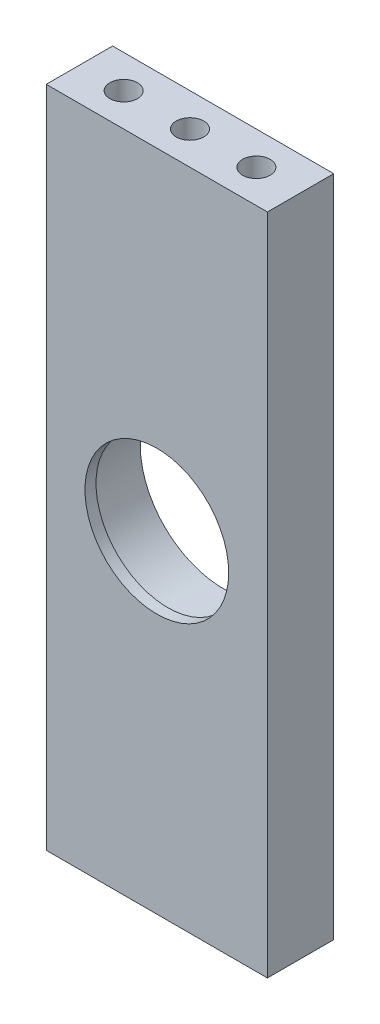
ISO-10303-21;
HEADER;
FILE_DESCRIPTION(('STEP AP214'),'2;1');
FILE_NAME('part.step','',(''),(''),'','','');
FILE_SCHEMA(('AUTOMOTIVE_DESIGN { 1 0 10303 214 1 1 1 1 }'));
ENDSEC;
DATA;
#1=APPLICATION_CONTEXT('core data for automotive mechanical design processes');
#2=APPLICATION_PROTOCOL_DEFINITION('international standard','automotive_design',2000,#1);
#3=PRODUCT_CONTEXT('',#1,'mechanical');
#4=PRODUCT('Part','Part','',(#3));
#5=PRODUCT_RELATED_PRODUCT_CATEGORY('part','',(#4));
#6=PRODUCT_DEFINITION_FORMATION('','',#4);
#7=PRODUCT_DEFINITION_CONTEXT('part definition',#1,'design');
#8=PRODUCT_DEFINITION('design','',#6,#7);
#9=PRODUCT_DEFINITION_SHAPE('','',#8);
#10=(LENGTH_UNIT() NAMED_UNIT(*) SI_UNIT(.MILLI.,.METRE.));
#11=(NAMED_UNIT(*) PLANE_ANGLE_UNIT() SI_UNIT($,.RADIAN.));
#12=(NAMED_UNIT(*) SI_UNIT($,.STERADIAN.) SOLID_ANGLE_UNIT());
#13=UNCERTAINTY_MEASURE_WITH_UNIT(LENGTH_MEASURE(1.E-05),#10,'distance_accuracy_value','');
#14=(GEOMETRIC_REPRESENTATION_CONTEXT(3) GLOBAL_UNCERTAINTY_ASSIGNED_CONTEXT((#13)) GLOBAL_UNIT_ASSIGNED_CONTEXT((#10,
#11,#12)) REPRESENTATION_CONTEXT('',''));
#15=CARTESIAN_POINT('',(0.,0.,0.));
#16=DIRECTION('',(0.,0.,1.));
#17=DIRECTION('',(1.,0.,0.));
#18=AXIS2_PLACEMENT_3D('',#15,#16,#17);
#19=CARTESIAN_POINT('',(2.21590909090908,20.7102272727273,6.));
#20=DIRECTION('',(0.,0.,-1.));
#21=DIRECTION('',(-1.,0.,0.));
#22=AXIS2_PLACEMENT_3D('',#19,#20,#21);
#23=CYLINDRICAL_SURFACE('',#22,7.5);
#24=CARTESIAN_POINT('',(2.21590909090908,20.7102272727273,0.));
#25=DIRECTION('',(0.,0.,1.));
#26=DIRECTION('',(1.,0.,0.));
#27=AXIS2_PLACEMENT_3D('',#24,#25,#26);
#28=CIRCLE('',#27,7.5);
#29=CARTESIAN_POINT('',(9.71590909090908,20.7102272727273,0.));
#30=VERTEX_POINT('',#29);
#31=EDGE_CURVE('E158',#30,#30,#28,.T.);
#32=ORIENTED_EDGE('',*,*,#31,.F.);
#33=EDGE_LOOP('',(#32));
#34=FACE_BOUND('',#33,.T.);
#35=CARTESIAN_POINT('',(2.21590909090908,20.7102272727273,5.));
#36=DIRECTION('',(0.,0.,1.));
#37=DIRECTION('',(1.,0.,0.));
#38=AXIS2_PLACEMENT_3D('',#35,#36,#37);
#39=CIRCLE('',#38,7.5);
#40=CARTESIAN_POINT('',(9.71590909090908,20.7102272727273,5.));
#41=VERTEX_POINT('',#40);
#42=EDGE_CURVE('E153',#41,#41,#39,.T.);
#43=ORIENTED_EDGE('',*,*,#42,.T.);
#44=EDGE_LOOP('',(#43));
#45=FACE_BOUND('',#44,.T.);
#46=ADVANCED_FACE('F38',(#34,#45),#23,.F.);
#47=CARTESIAN_POINT('',(0.,0.,6.));
#48=DIRECTION('',(0.,0.,-1.));
#49=DIRECTION('',(-1.,0.,0.));
#50=AXIS2_PLACEMENT_3D('',#47,#48,#49);
#51=PLANE('',#50);
#52=DIRECTION('',(0.,-1.,0.));
#53=VECTOR('',#52,1.);
#54=CARTESIAN_POINT('',(-7.78409090909092,20.7102272727273,6.));
#55=LINE('',#54,#53);
#56=CARTESIAN_POINT('',(-7.78409090909092,50.7102272727273,6.));
#57=VERTEX_POINT('',#56);
#58=CARTESIAN_POINT('',(-7.78409090909091,-9.28977272727273,6.));
#59=VERTEX_POINT('',#58);
#60=EDGE_CURVE('E84',#57,#59,#55,.T.);
#61=ORIENTED_EDGE('',*,*,#60,.T.);
#62=DIRECTION('',(1.,0.,0.));
#63=VECTOR('',#62,1.);
#64=CARTESIAN_POINT('',(-7.78409090909091,-9.28977272727273,6.));
#65=LINE('',#64,#63);
#66=CARTESIAN_POINT('',(12.2159090909091,-9.28977272727273,6.));
#67=VERTEX_POINT('',#66);
#68=EDGE_CURVE('E162',#59,#67,#65,.T.);
#69=ORIENTED_EDGE('',*,*,#68,.T.);
#70=DIRECTION('',(0.,1.,0.));
#71=VECTOR('',#70,1.);
#72=CARTESIAN_POINT('',(12.2159090909091,20.7102272727273,6.));
#73=LINE('',#72,#71);
#74=CARTESIAN_POINT('',(12.2159090909091,50.7102272727273,6.));
#75=VERTEX_POINT('',#74);
#76=EDGE_CURVE('E165',#67,#75,#73,.T.);
#77=ORIENTED_EDGE('',*,*,#76,.T.);
#78=DIRECTION('',(-1.,0.,0.));
#79=VECTOR('',#78,1.);
#80=CARTESIAN_POINT('',(-7.78409090909092,50.7102272727273,6.));
#81=LINE('',#80,#79);
#82=EDGE_CURVE('E55',#75,#57,#81,.T.);
#83=ORIENTED_EDGE('',*,*,#82,.T.);
#84=EDGE_LOOP('',(#61,#69,#77,#83));
#85=FACE_BOUND('',#84,.T.);
#86=CARTESIAN_POINT('',(2.21590909090908,20.7102272727273,6.));
#87=DIRECTION('',(0.,0.,1.));
#88=DIRECTION('',(1.,0.,0.));
#89=AXIS2_PLACEMENT_3D('',#86,#87,#88);
#90=CIRCLE('',#89,6.5);
#91=CARTESIAN_POINT('',(8.71590909090908,20.7102272727273,6.));
#92=VERTEX_POINT('',#91);
#93=EDGE_CURVE('E149',#92,#92,#90,.T.);
#94=ORIENTED_EDGE('',*,*,#93,.F.);
#95=EDGE_LOOP('',(#94));
#96=FACE_BOUND('',#95,.T.);
#97=ADVANCED_FACE('F195',(#85,#96),#51,.F.);
#98=CARTESIAN_POINT('',(0.,0.,0.));
#99=DIRECTION('',(0.,0.,-1.));
#100=DIRECTION('',(-1.,0.,0.));
#101=AXIS2_PLACEMENT_3D('',#98,#99,#100);
#102=PLANE('',#101);
#103=DIRECTION('',(0.,-1.,0.));
#104=VECTOR('',#103,1.);
#105=CARTESIAN_POINT('',(-7.78409090909092,20.7102272727273,0.));
#106=LINE('',#105,#104);
#107=CARTESIAN_POINT('',(-7.78409090909092,50.7102272727273,0.));
#108=VERTEX_POINT('',#107);
#109=CARTESIAN_POINT('',(-7.78409090909091,-9.28977272727273,0.));
#110=VERTEX_POINT('',#109);
#111=EDGE_CURVE('E79',#108,#110,#106,.T.);
#112=ORIENTED_EDGE('',*,*,#111,.F.);
#113=DIRECTION('',(-1.,0.,0.));
#114=VECTOR('',#113,1.);
#115=CARTESIAN_POINT('',(-7.78409090909092,50.7102272727273,0.));
#116=LINE('',#115,#114);
#117=CARTESIAN_POINT('',(12.2159090909091,50.7102272727273,0.));
#118=VERTEX_POINT('',#117);
#119=EDGE_CURVE('E163',#118,#108,#116,.T.);
#120=ORIENTED_EDGE('',*,*,#119,.F.);
#121=DIRECTION('',(0.,1.,0.));
#122=VECTOR('',#121,1.);
#123=CARTESIAN_POINT('',(12.2159090909091,20.7102272727273,0.));
#124=LINE('',#123,#122);
#125=CARTESIAN_POINT('',(12.2159090909091,-9.28977272727273,0.));
#126=VERTEX_POINT('',#125);
#127=EDGE_CURVE('E72',#126,#118,#124,.T.);
#128=ORIENTED_EDGE('',*,*,#127,.F.);
#129=DIRECTION('',(1.,0.,0.));
#130=VECTOR('',#129,1.);
#131=CARTESIAN_POINT('',(-7.78409090909091,-9.28977272727273,0.));
#132=LINE('',#131,#130);
#133=EDGE_CURVE('E170',#110,#126,#132,.T.);
#134=ORIENTED_EDGE('',*,*,#133,.F.);
#135=EDGE_LOOP('',(#112,#120,#128,#134));
#136=FACE_BOUND('',#135,.T.);
#137=ORIENTED_EDGE('',*,*,#31,.T.);
#138=EDGE_LOOP('',(#137));
#139=FACE_BOUND('',#138,.T.);
#140=ADVANCED_FACE('F184',(#136,#139),#102,.T.);
#141=CARTESIAN_POINT('',(-7.78409090909092,20.7102272727273,6.));
#142=DIRECTION('',(1.,0.,0.));
#143=DIRECTION('',(0.,1.,0.));
#144=AXIS2_PLACEMENT_3D('',#141,#142,#143);
#145=PLANE('',#144);
#146=ORIENTED_EDGE('',*,*,#111,.T.);
#147=DIRECTION('',(0.,0.,-1.));
#148=VECTOR('',#147,1.);
#149=CARTESIAN_POINT('',(-7.78409090909091,-9.28977272727273,6.));
#150=LINE('',#149,#148);
#151=EDGE_CURVE('E11',#59,#110,#150,.T.);
#152=ORIENTED_EDGE('',*,*,#151,.F.);
#153=ORIENTED_EDGE('',*,*,#60,.F.);
#154=DIRECTION('',(0.,0.,-1.));
#155=VECTOR('',#154,1.);
#156=CARTESIAN_POINT('',(-7.78409090909092,50.7102272727273,6.));
#157=LINE('',#156,#155);
#158=EDGE_CURVE('E168',#57,#108,#157,.T.);
#159=ORIENTED_EDGE('',*,*,#158,.T.);
#160=EDGE_LOOP('',(#146,#152,#153,#159));
#161=FACE_BOUND('',#160,.T.);
#162=ADVANCED_FACE('F40',(#161),#145,.F.);
#163=CARTESIAN_POINT('',(-7.78409090909091,-9.28977272727273,6.));
#164=DIRECTION('',(0.,1.,0.));
#165=DIRECTION('',(0.,0.,1.));
#166=AXIS2_PLACEMENT_3D('',#163,#164,#165);
#167=PLANE('',#166);
#168=CARTESIAN_POINT('',(-3.78409090909091,-9.28977272727273,3.));
#169=DIRECTION('',(0.,-1.,0.));
#170=DIRECTION('',(0.,0.,-1.));
#171=AXIS2_PLACEMENT_3D('',#168,#169,#170);
#172=CIRCLE('',#171,1.25);
#173=CARTESIAN_POINT('',(-3.78409090909091,-9.28977272727273,1.75));
#174=VERTEX_POINT('',#173);
#175=EDGE_CURVE('E131',#174,#174,#172,.T.);
#176=ORIENTED_EDGE('',*,*,#175,.F.);
#177=EDGE_LOOP('',(#176));
#178=FACE_BOUND('',#177,.T.);
#179=CARTESIAN_POINT('',(2.21590909090909,-9.28977272727273,3.));
#180=DIRECTION('',(0.,-1.,0.));
#181=DIRECTION('',(0.,0.,-1.));
#182=AXIS2_PLACEMENT_3D('',#179,#180,#181);
#183=CIRCLE('',#182,1.25);
#184=CARTESIAN_POINT('',(2.21590909090909,-9.28977272727273,1.75));
#185=VERTEX_POINT('',#184);
#186=EDGE_CURVE('E137',#185,#185,#183,.T.);
#187=ORIENTED_EDGE('',*,*,#186,.F.);
#188=EDGE_LOOP('',(#187));
#189=FACE_BOUND('',#188,.T.);
#190=CARTESIAN_POINT('',(8.21590909090909,-9.28977272727273,3.));
#191=DIRECTION('',(0.,-1.,0.));
#192=DIRECTION('',(0.,0.,-1.));
#193=AXIS2_PLACEMENT_3D('',#190,#191,#192);
#194=CIRCLE('',#193,1.25);
#195=CARTESIAN_POINT('',(8.21590909090909,-9.28977272727273,1.75));
#196=VERTEX_POINT('',#195);
#197=EDGE_CURVE('E143',#196,#196,#194,.T.);
#198=ORIENTED_EDGE('',*,*,#197,.F.);
#199=EDGE_LOOP('',(#198));
#200=FACE_BOUND('',#199,.T.);
#201=ORIENTED_EDGE('',*,*,#133,.T.);
#202=DIRECTION('',(0.,0.,-1.));
#203=VECTOR('',#202,1.);
#204=CARTESIAN_POINT('',(12.2159090909091,-9.28977272727273,6.));
#205=LINE('',#204,#203);
#206=EDGE_CURVE('E47',#67,#126,#205,.T.);
#207=ORIENTED_EDGE('',*,*,#206,.F.);
#208=ORIENTED_EDGE('',*,*,#68,.F.);
#209=ORIENTED_EDGE('',*,*,#151,.T.);
#210=EDGE_LOOP('',(#201,#207,#208,#209));
#211=FACE_BOUND('',#210,.T.);
#212=ADVANCED_FACE('F183',(#178,#189,#200,#211),#167,.F.);
#213=CARTESIAN_POINT('',(12.2159090909091,20.7102272727273,6.));
#214=DIRECTION('',(-1.,0.,0.));
#215=DIRECTION('',(0.,0.,1.));
#216=AXIS2_PLACEMENT_3D('',#213,#214,#215);
#217=PLANE('',#216);
#218=ORIENTED_EDGE('',*,*,#127,.T.);
#219=DIRECTION('',(0.,0.,-1.));
#220=VECTOR('',#219,1.);
#221=CARTESIAN_POINT('',(12.2159090909091,50.7102272727273,6.));
#222=LINE('',#221,#220);
#223=EDGE_CURVE('E177',#75,#118,#222,.T.);
#224=ORIENTED_EDGE('',*,*,#223,.F.);
#225=ORIENTED_EDGE('',*,*,#76,.F.);
#226=ORIENTED_EDGE('',*,*,#206,.T.);
#227=EDGE_LOOP('',(#218,#224,#225,#226));
#228=FACE_BOUND('',#227,.T.);
#229=ADVANCED_FACE('F180',(#228),#217,.F.);
#230=CARTESIAN_POINT('',(-7.78409090909092,50.7102272727273,6.));
#231=DIRECTION('',(0.,-1.,0.));
#232=DIRECTION('',(0.,0.,-1.));
#233=AXIS2_PLACEMENT_3D('',#230,#231,#232);
#234=PLANE('',#233);
#235=CARTESIAN_POINT('',(-3.78409090909091,50.7102272727273,3.));
#236=DIRECTION('',(0.,1.,0.));
#237=DIRECTION('',(0.,0.,1.));
#238=AXIS2_PLACEMENT_3D('',#235,#236,#237);
#239=CIRCLE('',#238,1.24999999999999);
#240=CARTESIAN_POINT('',(-3.78409090909091,50.7102272727273,4.24999999999999));
#241=VERTEX_POINT('',#240);
#242=EDGE_CURVE('E115',#241,#241,#239,.T.);
#243=ORIENTED_EDGE('',*,*,#242,.F.);
#244=EDGE_LOOP('',(#243));
#245=FACE_BOUND('',#244,.T.);
#246=CARTESIAN_POINT('',(2.21590909090909,50.7102272727273,3.));
#247=DIRECTION('',(0.,1.,0.));
#248=DIRECTION('',(0.,0.,1.));
#249=AXIS2_PLACEMENT_3D('',#246,#247,#248);
#250=CIRCLE('',#249,1.24999999999999);
#251=CARTESIAN_POINT('',(2.21590909090909,50.7102272727273,4.24999999999999));
#252=VERTEX_POINT('',#251);
#253=EDGE_CURVE('E114',#252,#252,#250,.T.);
#254=ORIENTED_EDGE('',*,*,#253,.F.);
#255=EDGE_LOOP('',(#254));
#256=FACE_BOUND('',#255,.T.);
#257=CARTESIAN_POINT('',(8.21590909090909,50.7102272727273,3.));
#258=DIRECTION('',(0.,1.,0.));
#259=DIRECTION('',(0.,0.,1.));
#260=AXIS2_PLACEMENT_3D('',#257,#258,#259);
#261=CIRCLE('',#260,1.24999999999999);
#262=CARTESIAN_POINT('',(8.21590909090909,50.7102272727273,4.24999999999999));
#263=VERTEX_POINT('',#262);
#264=EDGE_CURVE('E125',#263,#263,#261,.T.);
#265=ORIENTED_EDGE('',*,*,#264,.F.);
#266=EDGE_LOOP('',(#265));
#267=FACE_BOUND('',#266,.T.);
#268=ORIENTED_EDGE('',*,*,#119,.T.);
#269=ORIENTED_EDGE('',*,*,#158,.F.);
#270=ORIENTED_EDGE('',*,*,#82,.F.);
#271=ORIENTED_EDGE('',*,*,#223,.T.);
#272=EDGE_LOOP('',(#268,#269,#270,#271));
#273=FACE_BOUND('',#272,.T.);
#274=ADVANCED_FACE('F187',(#245,#256,#267,#273),#234,.F.);
#275=CARTESIAN_POINT('',(2.21590909090908,20.7102272727273,5.));
#276=DIRECTION('',(0.,0.,1.));
#277=DIRECTION('',(1.,0.,0.));
#278=AXIS2_PLACEMENT_3D('',#275,#276,#277);
#279=PLANE('',#278);
#280=CARTESIAN_POINT('',(2.21590909090908,20.7102272727273,5.));
#281=DIRECTION('',(0.,0.,1.));
#282=DIRECTION('',(1.,0.,0.));
#283=AXIS2_PLACEMENT_3D('',#280,#281,#282);
#284=CIRCLE('',#283,6.5);
#285=CARTESIAN_POINT('',(8.71590909090908,20.7102272727273,5.));
#286=VERTEX_POINT('',#285);
#287=EDGE_CURVE('E150',#286,#286,#284,.T.);
#288=ORIENTED_EDGE('',*,*,#287,.T.);
#289=EDGE_LOOP('',(#288));
#290=FACE_BOUND('',#289,.T.);
#291=ORIENTED_EDGE('',*,*,#42,.F.);
#292=EDGE_LOOP('',(#291));
#293=FACE_BOUND('',#292,.T.);
#294=ADVANCED_FACE('F207',(#290,#293),#279,.F.);
#295=CARTESIAN_POINT('',(2.21590909090908,20.7102272727273,5.));
#296=DIRECTION('',(0.,0.,1.));
#297=DIRECTION('',(1.,0.,0.));
#298=AXIS2_PLACEMENT_3D('',#295,#296,#297);
#299=CYLINDRICAL_SURFACE('',#298,6.5);
#300=ORIENTED_EDGE('',*,*,#287,.F.);
#301=EDGE_LOOP('',(#300));
#302=FACE_BOUND('',#301,.T.);
#303=ORIENTED_EDGE('',*,*,#93,.T.);
#304=EDGE_LOOP('',(#303));
#305=FACE_BOUND('',#304,.T.);
#306=ADVANCED_FACE('F230',(#302,#305),#299,.F.);
#307=CARTESIAN_POINT('',(8.21590909090909,0.710227272727272,3.));
#308=DIRECTION('',(0.,-1.,0.));
#309=DIRECTION('',(0.,0.,-1.));
#310=AXIS2_PLACEMENT_3D('',#307,#308,#309);
#311=CONICAL_SURFACE('',#310,1.25,1.02974425867665);
#312=CARTESIAN_POINT('',(8.21590909090908,1.46130304651172,3.));
#313=VERTEX_POINT('',#312);
#314=VERTEX_LOOP('',#313);
#315=FACE_BOUND('',#314,.T.);
#316=CARTESIAN_POINT('',(8.21590909090909,0.710227272727272,3.));
#317=DIRECTION('',(0.,-1.,0.));
#318=DIRECTION('',(0.,0.,-1.));
#319=AXIS2_PLACEMENT_3D('',#316,#317,#318);
#320=CIRCLE('',#319,1.25);
#321=CARTESIAN_POINT('',(8.21590909090909,0.710227272727272,1.75));
#322=VERTEX_POINT('',#321);
#323=EDGE_CURVE('E146',#322,#322,#320,.T.);
#324=ORIENTED_EDGE('',*,*,#323,.T.);
#325=EDGE_LOOP('',(#324));
#326=FACE_BOUND('',#325,.T.);
#327=ADVANCED_FACE('F238',(#315,#326),#311,.F.);
#328=CARTESIAN_POINT('',(8.21590909090909,-9.28977272727273,3.));
#329=DIRECTION('',(0.,-1.,0.));
#330=DIRECTION('',(0.,0.,-1.));
#331=AXIS2_PLACEMENT_3D('',#328,#329,#330);
#332=CYLINDRICAL_SURFACE('',#331,1.25);
#333=ORIENTED_EDGE('',*,*,#323,.F.);
#334=EDGE_LOOP('',(#333));
#335=FACE_BOUND('',#334,.T.);
#336=ORIENTED_EDGE('',*,*,#197,.T.);
#337=EDGE_LOOP('',(#336));
#338=FACE_BOUND('',#337,.T.);
#339=ADVANCED_FACE('F245',(#335,#338),#332,.F.);
#340=CARTESIAN_POINT('',(2.21590909090909,0.710227272727272,3.));
#341=DIRECTION('',(0.,-1.,0.));
#342=DIRECTION('',(0.,0.,-1.));
#343=AXIS2_PLACEMENT_3D('',#340,#341,#342);
#344=CONICAL_SURFACE('',#343,1.25,1.02974425867665);
#345=CARTESIAN_POINT('',(2.21590909090909,1.46130304651172,3.));
#346=VERTEX_POINT('',#345);
#347=VERTEX_LOOP('',#346);
#348=FACE_BOUND('',#347,.T.);
#349=CARTESIAN_POINT('',(2.21590909090909,0.710227272727272,3.));
#350=DIRECTION('',(0.,-1.,0.));
#351=DIRECTION('',(0.,0.,-1.));
#352=AXIS2_PLACEMENT_3D('',#349,#350,#351);
#353=CIRCLE('',#352,1.25);
#354=CARTESIAN_POINT('',(2.21590909090909,0.710227272727272,1.75));
#355=VERTEX_POINT('',#354);
#356=EDGE_CURVE('E140',#355,#355,#353,.T.);
#357=ORIENTED_EDGE('',*,*,#356,.T.);
#358=EDGE_LOOP('',(#357));
#359=FACE_BOUND('',#358,.T.);
#360=ADVANCED_FACE('F254',(#348,#359),#344,.F.);
#361=CARTESIAN_POINT('',(2.21590909090909,-9.28977272727273,3.));
#362=DIRECTION('',(0.,-1.,0.));
#363=DIRECTION('',(0.,0.,-1.));
#364=AXIS2_PLACEMENT_3D('',#361,#362,#363);
#365=CYLINDRICAL_SURFACE('',#364,1.25);
#366=ORIENTED_EDGE('',*,*,#356,.F.);
#367=EDGE_LOOP('',(#366));
#368=FACE_BOUND('',#367,.T.);
#369=ORIENTED_EDGE('',*,*,#186,.T.);
#370=EDGE_LOOP('',(#369));
#371=FACE_BOUND('',#370,.T.);
#372=ADVANCED_FACE('F263',(#368,#371),#365,.F.);
#373=CARTESIAN_POINT('',(-3.78409090909091,0.710227272727272,3.));
#374=DIRECTION('',(0.,-1.,0.));
#375=DIRECTION('',(0.,0.,-1.));
#376=AXIS2_PLACEMENT_3D('',#373,#374,#375);
#377=CONICAL_SURFACE('',#376,1.25,1.02974425867665);
#378=CARTESIAN_POINT('',(-3.78409090909092,1.46130304651172,3.));
#379=VERTEX_POINT('',#378);
#380=VERTEX_LOOP('',#379);
#381=FACE_BOUND('',#380,.T.);
#382=CARTESIAN_POINT('',(-3.78409090909091,0.710227272727272,3.));
#383=DIRECTION('',(0.,-1.,0.));
#384=DIRECTION('',(0.,0.,-1.));
#385=AXIS2_PLACEMENT_3D('',#382,#383,#384);
#386=CIRCLE('',#385,1.25);
#387=CARTESIAN_POINT('',(-3.78409090909091,0.710227272727272,1.75));
#388=VERTEX_POINT('',#387);
#389=EDGE_CURVE('E134',#388,#388,#386,.T.);
#390=ORIENTED_EDGE('',*,*,#389,.T.);
#391=EDGE_LOOP('',(#390));
#392=FACE_BOUND('',#391,.T.);
#393=ADVANCED_FACE('F271',(#381,#392),#377,.F.);
#394=CARTESIAN_POINT('',(-3.78409090909091,-9.28977272727273,3.));
#395=DIRECTION('',(0.,-1.,0.));
#396=DIRECTION('',(0.,0.,-1.));
#397=AXIS2_PLACEMENT_3D('',#394,#395,#396);
#398=CYLINDRICAL_SURFACE('',#397,1.25);
#399=ORIENTED_EDGE('',*,*,#389,.F.);
#400=EDGE_LOOP('',(#399));
#401=FACE_BOUND('',#400,.T.);
#402=ORIENTED_EDGE('',*,*,#175,.T.);
#403=EDGE_LOOP('',(#402));
#404=FACE_BOUND('',#403,.T.);
#405=ADVANCED_FACE('F280',(#401,#404),#398,.F.);
#406=CARTESIAN_POINT('',(8.21590909090909,40.7102272727273,3.));
#407=DIRECTION('',(0.,1.,0.));
#408=DIRECTION('',(0.,0.,1.));
#409=AXIS2_PLACEMENT_3D('',#406,#407,#408);
#410=CONICAL_SURFACE('',#409,1.25,1.02974425867665);
#411=CARTESIAN_POINT('',(8.21590909090908,39.9591514989428,3.));
#412=VERTEX_POINT('',#411);
#413=VERTEX_LOOP('',#412);
#414=FACE_BOUND('',#413,.T.);
#415=CARTESIAN_POINT('',(8.21590909090909,40.7102272727273,3.));
#416=DIRECTION('',(0.,1.,0.));
#417=DIRECTION('',(0.,0.,1.));
#418=AXIS2_PLACEMENT_3D('',#415,#416,#417);
#419=CIRCLE('',#418,1.25);
#420=CARTESIAN_POINT('',(8.21590909090909,40.7102272727273,4.25));
#421=VERTEX_POINT('',#420);
#422=EDGE_CURVE('E128',#421,#421,#419,.T.);
#423=ORIENTED_EDGE('',*,*,#422,.T.);
#424=EDGE_LOOP('',(#423));
#425=FACE_BOUND('',#424,.T.);
#426=ADVANCED_FACE('F287',(#414,#425),#410,.F.);
#427=CARTESIAN_POINT('',(8.21590909090909,50.7102272727273,3.));
#428=DIRECTION('',(0.,1.,0.));
#429=DIRECTION('',(0.,0.,1.));
#430=AXIS2_PLACEMENT_3D('',#427,#428,#429);
#431=CYLINDRICAL_SURFACE('',#430,1.24999999999999);
#432=ORIENTED_EDGE('',*,*,#422,.F.);
#433=EDGE_LOOP('',(#432));
#434=FACE_BOUND('',#433,.T.);
#435=ORIENTED_EDGE('',*,*,#264,.T.);
#436=EDGE_LOOP('',(#435));
#437=FACE_BOUND('',#436,.T.);
#438=ADVANCED_FACE('F295',(#434,#437),#431,.F.);
#439=CARTESIAN_POINT('',(2.21590909090909,40.7102272727273,3.));
#440=DIRECTION('',(0.,1.,0.));
#441=DIRECTION('',(0.,0.,1.));
#442=AXIS2_PLACEMENT_3D('',#439,#440,#441);
#443=CONICAL_SURFACE('',#442,1.25,1.02974425867665);
#444=CARTESIAN_POINT('',(2.21590909090909,39.9591514989428,3.));
#445=VERTEX_POINT('',#444);
#446=VERTEX_LOOP('',#445);
#447=FACE_BOUND('',#446,.T.);
#448=CARTESIAN_POINT('',(2.21590909090909,40.7102272727273,3.));
#449=DIRECTION('',(0.,1.,0.));
#450=DIRECTION('',(0.,0.,1.));
#451=AXIS2_PLACEMENT_3D('',#448,#449,#450);
#452=CIRCLE('',#451,1.25);
#453=CARTESIAN_POINT('',(2.21590909090909,40.7102272727273,4.25));
#454=VERTEX_POINT('',#453);
#455=EDGE_CURVE('E118',#454,#454,#452,.T.);
#456=ORIENTED_EDGE('',*,*,#455,.T.);
#457=EDGE_LOOP('',(#456));
#458=FACE_BOUND('',#457,.T.);
#459=ADVANCED_FACE('F303',(#447,#458),#443,.F.);
#460=CARTESIAN_POINT('',(2.21590909090909,50.7102272727273,3.));
#461=DIRECTION('',(0.,1.,0.));
#462=DIRECTION('',(0.,0.,1.));
#463=AXIS2_PLACEMENT_3D('',#460,#461,#462);
#464=CYLINDRICAL_SURFACE('',#463,1.24999999999999);
#465=ORIENTED_EDGE('',*,*,#455,.F.);
#466=EDGE_LOOP('',(#465));
#467=FACE_BOUND('',#466,.T.);
#468=ORIENTED_EDGE('',*,*,#253,.T.);
#469=EDGE_LOOP('',(#468));
#470=FACE_BOUND('',#469,.T.);
#471=ADVANCED_FACE('F108',(#467,#470),#464,.F.);
#472=CARTESIAN_POINT('',(-3.78409090909091,40.7102272727273,3.));
#473=DIRECTION('',(0.,1.,0.));
#474=DIRECTION('',(0.,0.,1.));
#475=AXIS2_PLACEMENT_3D('',#472,#473,#474);
#476=CONICAL_SURFACE('',#475,1.25,1.02974425867665);
#477=CARTESIAN_POINT('',(-3.78409090909092,39.9591514989428,3.));
#478=VERTEX_POINT('',#477);
#479=VERTEX_LOOP('',#478);
#480=FACE_BOUND('',#479,.T.);
#481=CARTESIAN_POINT('',(-3.78409090909091,40.7102272727273,3.));
#482=DIRECTION('',(0.,1.,0.));
#483=DIRECTION('',(0.,0.,1.));
#484=AXIS2_PLACEMENT_3D('',#481,#482,#483);
#485=CIRCLE('',#484,1.25);
#486=CARTESIAN_POINT('',(-3.78409090909091,40.7102272727273,4.25));
#487=VERTEX_POINT('',#486);
#488=EDGE_CURVE('E112',#487,#487,#485,.T.);
#489=ORIENTED_EDGE('',*,*,#488,.T.);
#490=EDGE_LOOP('',(#489));
#491=FACE_BOUND('',#490,.T.);
#492=ADVANCED_FACE('F104',(#480,#491),#476,.F.);
#493=CARTESIAN_POINT('',(-3.78409090909091,50.7102272727273,3.));
#494=DIRECTION('',(0.,1.,0.));
#495=DIRECTION('',(0.,0.,1.));
#496=AXIS2_PLACEMENT_3D('',#493,#494,#495);
#497=CYLINDRICAL_SURFACE('',#496,1.24999999999999);
#498=ORIENTED_EDGE('',*,*,#488,.F.);
#499=EDGE_LOOP('',(#498));
#500=FACE_BOUND('',#499,.T.);
#501=ORIENTED_EDGE('',*,*,#242,.T.);
#502=EDGE_LOOP('',(#501));
#503=FACE_BOUND('',#502,.T.);
#504=ADVANCED_FACE('F107',(#500,#503),#497,.F.);
#505=CLOSED_SHELL('',(#46,#97,#140,#162,#212,#229,#274,#294,#306,#327,#339,#360,#372,#393,#405,
#426,#438,#459,#471,#492,#504));
#506=MANIFOLD_SOLID_BREP('B2',#505);
#507=ADVANCED_BREP_SHAPE_REPRESENTATION('',(#18,#506),#14);
#508=SHAPE_DEFINITION_REPRESENTATION(#9,#507);
ENDSEC;
END-ISO-10303-21;
